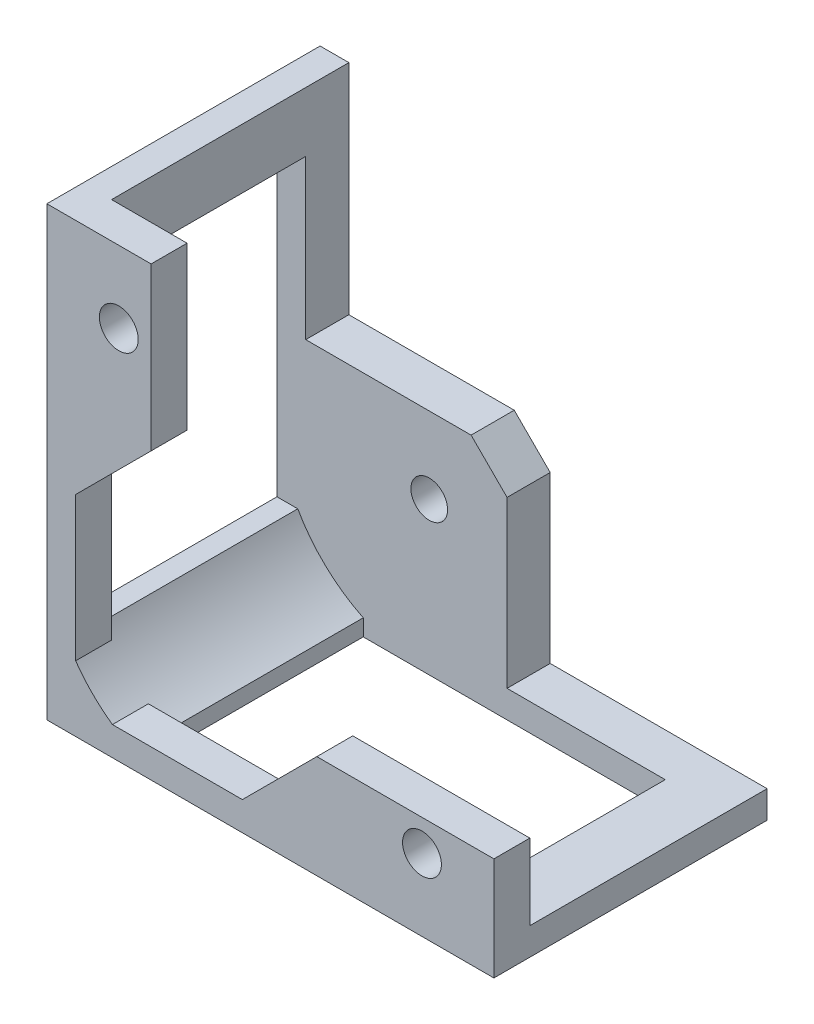
ISO-10303-21;
HEADER;
FILE_DESCRIPTION(('STEP AP214'),'2;1');
FILE_NAME('part.step','',(''),(''),'','','');
FILE_SCHEMA(('AUTOMOTIVE_DESIGN { 1 0 10303 214 1 1 1 1 }'));
ENDSEC;
DATA;
#1=APPLICATION_CONTEXT('core data for automotive mechanical design processes');
#2=APPLICATION_PROTOCOL_DEFINITION('international standard','automotive_design',2000,#1);
#3=PRODUCT_CONTEXT('',#1,'mechanical');
#4=PRODUCT('Part','Part','',(#3));
#5=PRODUCT_RELATED_PRODUCT_CATEGORY('part','',(#4));
#6=PRODUCT_DEFINITION_FORMATION('','',#4);
#7=PRODUCT_DEFINITION_CONTEXT('part definition',#1,'design');
#8=PRODUCT_DEFINITION('design','',#6,#7);
#9=PRODUCT_DEFINITION_SHAPE('','',#8);
#10=(LENGTH_UNIT() NAMED_UNIT(*) SI_UNIT(.MILLI.,.METRE.));
#11=(NAMED_UNIT(*) PLANE_ANGLE_UNIT() SI_UNIT($,.RADIAN.));
#12=(NAMED_UNIT(*) SI_UNIT($,.STERADIAN.) SOLID_ANGLE_UNIT());
#13=UNCERTAINTY_MEASURE_WITH_UNIT(LENGTH_MEASURE(1.E-05),#10,'distance_accuracy_value','');
#14=(GEOMETRIC_REPRESENTATION_CONTEXT(3) GLOBAL_UNCERTAINTY_ASSIGNED_CONTEXT((#13)) GLOBAL_UNIT_ASSIGNED_CONTEXT((#10,
#11,#12)) REPRESENTATION_CONTEXT('',''));
#15=CARTESIAN_POINT('',(0.,0.,0.));
#16=DIRECTION('',(0.,0.,1.));
#17=DIRECTION('',(1.,0.,0.));
#18=AXIS2_PLACEMENT_3D('',#15,#16,#17);
#19=CARTESIAN_POINT('',(-170.,-122.805556255077,-421.));
#20=DIRECTION('',(0.,0.,-1.));
#21=DIRECTION('',(1.,0.,0.));
#22=AXIS2_PLACEMENT_3D('',#19,#20,#21);
#23=CYLINDRICAL_SURFACE('',#22,2.7);
#24=CARTESIAN_POINT('',(-170.,-122.805556255077,-421.));
#25=DIRECTION('',(0.,0.,-1.));
#26=DIRECTION('',(1.,0.,0.));
#27=AXIS2_PLACEMENT_3D('',#24,#25,#26);
#28=CIRCLE('',#27,2.7);
#29=CARTESIAN_POINT('',(-172.7,-122.805556255077,-421.));
#30=VERTEX_POINT('',#29);
#31=EDGE_CURVE('E460',#30,#30,#28,.T.);
#32=ORIENTED_EDGE('',*,*,#31,.T.);
#33=DIRECTION('',(0.,0.,1.));
#34=VECTOR('',#33,1.);
#35=CARTESIAN_POINT('',(-172.7,-122.805556255077,-421.));
#36=LINE('',#35,#34);
#37=CARTESIAN_POINT('',(-172.7,-122.805556255077,-416.));
#38=VERTEX_POINT('',#37);
#39=EDGE_CURVE('E11',#30,#38,#36,.T.);
#40=ORIENTED_EDGE('',*,*,#39,.T.);
#41=CARTESIAN_POINT('',(-170.,-122.805556255077,-416.));
#42=DIRECTION('',(0.,0.,1.));
#43=DIRECTION('',(1.,0.,0.));
#44=AXIS2_PLACEMENT_3D('',#41,#42,#43);
#45=CIRCLE('',#44,2.7);
#46=EDGE_CURVE('E279',#38,#38,#45,.T.);
#47=ORIENTED_EDGE('',*,*,#46,.T.);
#48=ORIENTED_EDGE('',*,*,#39,.F.);
#49=EDGE_LOOP('',(#32,#40,#47,#48));
#50=FACE_BOUND('',#49,.T.);
#51=ADVANCED_FACE('F16',(#50),#23,.F.);
#52=CARTESIAN_POINT('',(-127.830959656274,-164.974596598802,-421.));
#53=DIRECTION('',(0.,0.,-1.));
#54=DIRECTION('',(1.,0.,0.));
#55=AXIS2_PLACEMENT_3D('',#52,#53,#54);
#56=CYLINDRICAL_SURFACE('',#55,2.7);
#57=CARTESIAN_POINT('',(-127.830959656274,-164.974596598802,-421.));
#58=DIRECTION('',(0.,0.,-1.));
#59=DIRECTION('',(1.,0.,0.));
#60=AXIS2_PLACEMENT_3D('',#57,#58,#59);
#61=CIRCLE('',#60,2.7);
#62=CARTESIAN_POINT('',(-130.530959656274,-164.974596598802,-421.));
#63=VERTEX_POINT('',#62);
#64=EDGE_CURVE('E339',#63,#63,#61,.T.);
#65=ORIENTED_EDGE('',*,*,#64,.T.);
#66=DIRECTION('',(0.,0.,1.));
#67=VECTOR('',#66,1.);
#68=CARTESIAN_POINT('',(-130.530959656274,-164.974596598802,-421.));
#69=LINE('',#68,#67);
#70=CARTESIAN_POINT('',(-130.530959656274,-164.974596598802,-416.));
#71=VERTEX_POINT('',#70);
#72=EDGE_CURVE('E27',#63,#71,#69,.T.);
#73=ORIENTED_EDGE('',*,*,#72,.T.);
#74=CARTESIAN_POINT('',(-127.830959656274,-164.974596598802,-416.));
#75=DIRECTION('',(0.,0.,1.));
#76=DIRECTION('',(1.,0.,0.));
#77=AXIS2_PLACEMENT_3D('',#74,#75,#76);
#78=CIRCLE('',#77,2.7);
#79=EDGE_CURVE('E331',#71,#71,#78,.T.);
#80=ORIENTED_EDGE('',*,*,#79,.T.);
#81=ORIENTED_EDGE('',*,*,#72,.F.);
#82=EDGE_LOOP('',(#65,#73,#80,#81));
#83=FACE_BOUND('',#82,.T.);
#84=ADVANCED_FACE('F932',(#83),#56,.F.);
#85=CARTESIAN_POINT('',(-144.000000730157,-148.037299163668,-421.));
#86=DIRECTION('',(0.,0.,1.));
#87=DIRECTION('',(1.,0.,0.));
#88=AXIS2_PLACEMENT_3D('',#85,#86,#87);
#89=PLANE('',#88);
#90=ORIENTED_EDGE('',*,*,#31,.F.);
#91=EDGE_LOOP('',(#90));
#92=FACE_BOUND('',#91,.T.);
#93=DIRECTION('',(0.,-1.,0.));
#94=VECTOR('',#93,1.);
#95=CARTESIAN_POINT('',(-165.504335240787,-140.685936356161,-421.));
#96=LINE('',#95,#94);
#97=CARTESIAN_POINT('',(-165.504335240787,-112.805556255077,-421.));
#98=VERTEX_POINT('',#97);
#99=CARTESIAN_POINT('',(-165.504335240787,-135.328908789441,-421.));
#100=VERTEX_POINT('',#99);
#101=EDGE_CURVE('E326',#98,#100,#96,.T.);
#102=ORIENTED_EDGE('',*,*,#101,.T.);
#103=DIRECTION('',(0.707106781186548,0.707106781186547,0.));
#104=VECTOR('',#103,1.);
#105=CARTESIAN_POINT('',(-165.430681586293,-135.255255134946,-421.));
#106=LINE('',#105,#104);
#107=CARTESIAN_POINT('',(-176.,-145.824573548653,-421.));
#108=VERTEX_POINT('',#107);
#109=EDGE_CURVE('E330',#108,#100,#106,.T.);
#110=ORIENTED_EDGE('',*,*,#109,.F.);
#111=DIRECTION('',(0.,-1.,0.));
#112=VECTOR('',#111,1.);
#113=CARTESIAN_POINT('',(-176.,-112.805556255077,-421.));
#114=LINE('',#113,#112);
#115=CARTESIAN_POINT('',(-176.,-165.858549293677,-421.));
#116=VERTEX_POINT('',#115);
#117=EDGE_CURVE('E449',#108,#116,#114,.T.);
#118=ORIENTED_EDGE('',*,*,#117,.T.);
#119=CARTESIAN_POINT('',(-158.82150839458,-153.796104993382,-421.));
#120=DIRECTION('',(0.,0.,1.));
#121=DIRECTION('',(1.,0.,0.));
#122=AXIS2_PLACEMENT_3D('',#119,#120,#121);
#123=CIRCLE('',#122,20.9905487383057);
#124=CARTESIAN_POINT('',(-177.109013287322,-164.100002369285,-421.000004917383));
#125=VERTEX_POINT('',#124);
#126=EDGE_CURVE('E425',#125,#116,#123,.T.);
#127=ORIENTED_EDGE('',*,*,#126,.F.);
#128=DIRECTION('',(1.,0.,0.));
#129=VECTOR('',#128,1.);
#130=CARTESIAN_POINT('',(-180.,-164.100002369285,-421.000004917383));
#131=LINE('',#130,#129);
#132=CARTESIAN_POINT('',(-180.,-164.100002369285,-421.000004917383));
#133=VERTEX_POINT('',#132);
#134=EDGE_CURVE('E439',#133,#125,#131,.T.);
#135=ORIENTED_EDGE('',*,*,#134,.F.);
#136=DIRECTION('',(0.,-1.,0.));
#137=VECTOR('',#136,1.);
#138=CARTESIAN_POINT('',(-180.,-121.100001728535,-421.000004917383));
#139=LINE('',#138,#137);
#140=CARTESIAN_POINT('',(-180.,-121.100001728535,-421.000004917383));
#141=VERTEX_POINT('',#140);
#142=EDGE_CURVE('E365',#141,#133,#139,.T.);
#143=ORIENTED_EDGE('',*,*,#142,.F.);
#144=DIRECTION('',(-1.,0.,0.));
#145=VECTOR('',#144,1.);
#146=CARTESIAN_POINT('',(-180.,-121.100001728535,-421.000004917383));
#147=LINE('',#146,#145);
#148=CARTESIAN_POINT('',(-176.,-121.100001728535,-421.000004917383));
#149=VERTEX_POINT('',#148);
#150=EDGE_CURVE('E445',#149,#141,#147,.T.);
#151=ORIENTED_EDGE('',*,*,#150,.F.);
#152=DIRECTION('',(0.,1.,0.));
#153=VECTOR('',#152,1.);
#154=CARTESIAN_POINT('',(-176.,-130.421427709373,-421.));
#155=LINE('',#154,#153);
#156=CARTESIAN_POINT('',(-176.,-112.805556255077,-421.));
#157=VERTEX_POINT('',#156);
#158=EDGE_CURVE('E377',#149,#157,#155,.T.);
#159=ORIENTED_EDGE('',*,*,#158,.T.);
#160=DIRECTION('',(-1.,0.,0.));
#161=VECTOR('',#160,1.);
#162=CARTESIAN_POINT('',(-160.,-112.805556255077,-421.));
#163=LINE('',#162,#161);
#164=EDGE_CURVE('E451',#98,#157,#163,.T.);
#165=ORIENTED_EDGE('',*,*,#164,.F.);
#166=EDGE_LOOP('',(#102,#110,#118,#127,#135,#143,#151,#159,#165));
#167=FACE_BOUND('',#166,.T.);
#168=ADVANCED_FACE('F639',(#92,#167),#89,.F.);
#169=CARTESIAN_POINT('',(-180.,-112.805556255077,-421.));
#170=DIRECTION('',(0.,-1.,0.));
#171=DIRECTION('',(0.,0.,-1.));
#172=AXIS2_PLACEMENT_3D('',#169,#170,#171);
#173=PLANE('',#172);
#174=ORIENTED_EDGE('',*,*,#164,.T.);
#175=DIRECTION('',(0.,0.,-1.));
#176=VECTOR('',#175,1.);
#177=CARTESIAN_POINT('',(-176.,-112.805556255077,-421.));
#178=LINE('',#177,#176);
#179=CARTESIAN_POINT('',(-176.,-112.805556255077,-454.));
#180=VERTEX_POINT('',#179);
#181=EDGE_CURVE('E382',#157,#180,#178,.T.);
#182=ORIENTED_EDGE('',*,*,#181,.T.);
#183=DIRECTION('',(1.,0.,0.));
#184=VECTOR('',#183,1.);
#185=CARTESIAN_POINT('',(-180.,-112.805556255077,-454.));
#186=LINE('',#185,#184);
#187=CARTESIAN_POINT('',(-180.,-112.805556255077,-454.));
#188=VERTEX_POINT('',#187);
#189=EDGE_CURVE('E413',#188,#180,#186,.T.);
#190=ORIENTED_EDGE('',*,*,#189,.F.);
#191=DIRECTION('',(0.,0.,1.));
#192=VECTOR('',#191,1.);
#193=CARTESIAN_POINT('',(-180.,-112.805556255077,-418.5));
#194=LINE('',#193,#192);
#195=CARTESIAN_POINT('',(-180.,-112.805556255077,-416.));
#196=VERTEX_POINT('',#195);
#197=EDGE_CURVE('E137',#188,#196,#194,.T.);
#198=ORIENTED_EDGE('',*,*,#197,.T.);
#199=DIRECTION('',(1.,0.,0.));
#200=VECTOR('',#199,1.);
#201=CARTESIAN_POINT('',(-166.004335240787,-112.805556255077,-416.));
#202=LINE('',#201,#200);
#203=CARTESIAN_POINT('',(-165.504335240787,-112.805556255077,-416.));
#204=VERTEX_POINT('',#203);
#205=EDGE_CURVE('E335',#196,#204,#202,.T.);
#206=ORIENTED_EDGE('',*,*,#205,.T.);
#207=DIRECTION('',(0.,0.,1.));
#208=VECTOR('',#207,1.);
#209=CARTESIAN_POINT('',(-165.504335240787,-112.805556255077,-418.5));
#210=LINE('',#209,#208);
#211=EDGE_CURVE('E329',#98,#204,#210,.T.);
#212=ORIENTED_EDGE('',*,*,#211,.F.);
#213=EDGE_LOOP('',(#174,#182,#190,#198,#206,#212));
#214=FACE_BOUND('',#213,.T.);
#215=ADVANCED_FACE('F644',(#214),#173,.F.);
#216=CARTESIAN_POINT('',(-137.960368081204,-170.974596598802,-416.));
#217=DIRECTION('',(0.,-1.,0.));
#218=DIRECTION('',(0.,0.,-1.));
#219=AXIS2_PLACEMENT_3D('',#216,#217,#218);
#220=PLANE('',#219);
#221=DIRECTION('',(0.,0.,1.));
#222=VECTOR('',#221,1.);
#223=CARTESIAN_POINT('',(-152.810368081204,-170.974596598802,-416.));
#224=LINE('',#223,#222);
#225=CARTESIAN_POINT('',(-152.810368081204,-170.974596598802,-421.));
#226=VERTEX_POINT('',#225);
#227=CARTESIAN_POINT('',(-152.810368081204,-170.974596598802,-416.));
#228=VERTEX_POINT('',#227);
#229=EDGE_CURVE('E444',#226,#228,#224,.T.);
#230=ORIENTED_EDGE('',*,*,#229,.F.);
#231=DIRECTION('',(1.,0.,0.));
#232=VECTOR('',#231,1.);
#233=CARTESIAN_POINT('',(-140.98018440568,-170.974596598802,-421.));
#234=LINE('',#233,#232);
#235=CARTESIAN_POINT('',(-170.883952694875,-170.974596598802,-421.));
#236=VERTEX_POINT('',#235);
#237=EDGE_CURVE('E285',#236,#226,#234,.T.);
#238=ORIENTED_EDGE('',*,*,#237,.F.);
#239=DIRECTION('',(0.,0.,-1.));
#240=VECTOR('',#239,1.);
#241=CARTESIAN_POINT('',(-170.883952694875,-170.974596598802,-454.));
#242=LINE('',#241,#240);
#243=CARTESIAN_POINT('',(-170.883952694875,-170.974596598802,-416.));
#244=VERTEX_POINT('',#243);
#245=EDGE_CURVE('E440',#244,#236,#242,.T.);
#246=ORIENTED_EDGE('',*,*,#245,.F.);
#247=DIRECTION('',(-1.,0.,0.));
#248=VECTOR('',#247,1.);
#249=CARTESIAN_POINT('',(-117.830959656274,-170.974596598802,-416.));
#250=LINE('',#249,#248);
#251=EDGE_CURVE('E376',#228,#244,#250,.T.);
#252=ORIENTED_EDGE('',*,*,#251,.F.);
#253=EDGE_LOOP('',(#230,#238,#246,#252));
#254=FACE_BOUND('',#253,.T.);
#255=ADVANCED_FACE('F612',(#254),#220,.F.);
#256=CARTESIAN_POINT('',(-126.000001728535,-174.974596598802,-425.000004902482));
#257=DIRECTION('',(1.,0.,0.));
#258=DIRECTION('',(0.,1.,0.));
#259=AXIS2_PLACEMENT_3D('',#256,#257,#258);
#260=PLANE('',#259);
#261=DIRECTION('',(0.,-1.,0.));
#262=VECTOR('',#261,1.);
#263=CARTESIAN_POINT('',(-126.000001728535,-164.385350796092,-448.));
#264=LINE('',#263,#262);
#265=CARTESIAN_POINT('',(-126.000001728535,-171.171527858595,-448.000005155802));
#266=VERTEX_POINT('',#265);
#267=CARTESIAN_POINT('',(-126.000001728535,-174.974596598802,-448.000005155802));
#268=VERTEX_POINT('',#267);
#269=EDGE_CURVE('E307',#266,#268,#264,.T.);
#270=ORIENTED_EDGE('',*,*,#269,.T.);
#271=DIRECTION('',(0.,0.,-1.));
#272=VECTOR('',#271,1.);
#273=CARTESIAN_POINT('',(-126.000001728535,-174.974596598802,-429.000002577901));
#274=LINE('',#273,#272);
#275=CARTESIAN_POINT('',(-126.000001728535,-174.974596598802,-421.000004902482));
#276=VERTEX_POINT('',#275);
#277=EDGE_CURVE('E441',#276,#268,#274,.T.);
#278=ORIENTED_EDGE('',*,*,#277,.F.);
#279=DIRECTION('',(0.,1.,0.));
#280=VECTOR('',#279,1.);
#281=CARTESIAN_POINT('',(-126.000001728535,-174.974596598802,-421.000004902482));
#282=LINE('',#281,#280);
#283=CARTESIAN_POINT('',(-126.000001728535,-171.171527858595,-421.000004902482));
#284=VERTEX_POINT('',#283);
#285=EDGE_CURVE('E474',#276,#284,#282,.T.);
#286=ORIENTED_EDGE('',*,*,#285,.T.);
#287=DIRECTION('',(0.,0.,1.));
#288=VECTOR('',#287,1.);
#289=CARTESIAN_POINT('',(-126.000001728535,-171.171527858595,-431.500002577901));
#290=LINE('',#289,#288);
#291=EDGE_CURVE('E269',#266,#284,#290,.T.);
#292=ORIENTED_EDGE('',*,*,#291,.F.);
#293=EDGE_LOOP('',(#270,#278,#286,#292));
#294=FACE_BOUND('',#293,.T.);
#295=ADVANCED_FACE('F597',(#294),#260,.F.);
#296=CARTESIAN_POINT('',(-176.,-112.805556255077,-421.));
#297=DIRECTION('',(1.,0.,0.));
#298=DIRECTION('',(0.,1.,0.));
#299=AXIS2_PLACEMENT_3D('',#296,#297,#298);
#300=PLANE('',#299);
#301=DIRECTION('',(0.,0.,-1.));
#302=VECTOR('',#301,1.);
#303=CARTESIAN_POINT('',(-176.,-145.824573548653,-418.5));
#304=LINE('',#303,#302);
#305=CARTESIAN_POINT('',(-176.,-145.824573548653,-416.));
#306=VERTEX_POINT('',#305);
#307=EDGE_CURVE('E398',#306,#108,#304,.T.);
#308=ORIENTED_EDGE('',*,*,#307,.F.);
#309=DIRECTION('',(0.,-1.,0.));
#310=VECTOR('',#309,1.);
#311=CARTESIAN_POINT('',(-176.,-112.805556255077,-416.));
#312=LINE('',#311,#310);
#313=CARTESIAN_POINT('',(-176.,-165.858549293677,-416.));
#314=VERTEX_POINT('',#313);
#315=EDGE_CURVE('E426',#306,#314,#312,.T.);
#316=ORIENTED_EDGE('',*,*,#315,.T.);
#317=DIRECTION('',(0.,0.,1.));
#318=VECTOR('',#317,1.);
#319=CARTESIAN_POINT('',(-176.,-165.858549293677,-454.));
#320=LINE('',#319,#318);
#321=EDGE_CURVE('E480',#116,#314,#320,.T.);
#322=ORIENTED_EDGE('',*,*,#321,.F.);
#323=ORIENTED_EDGE('',*,*,#117,.F.);
#324=EDGE_LOOP('',(#308,#316,#322,#323));
#325=FACE_BOUND('',#324,.T.);
#326=ADVANCED_FACE('F656',(#325),#300,.T.);
#327=CARTESIAN_POINT('',(-145.385368081204,-163.549596598802,-416.));
#328=DIRECTION('',(-0.707106781186548,0.707106781186548,0.));
#329=DIRECTION('',(0.,0.,1.));
#330=AXIS2_PLACEMENT_3D('',#327,#328,#329);
#331=PLANE('',#330);
#332=DIRECTION('',(0.,0.,-1.));
#333=VECTOR('',#332,1.);
#334=CARTESIAN_POINT('',(-142.459098244505,-160.623326762104,-418.5));
#335=LINE('',#334,#333);
#336=CARTESIAN_POINT('',(-142.459098244505,-160.623326762104,-416.));
#337=VERTEX_POINT('',#336);
#338=CARTESIAN_POINT('',(-142.459098244505,-160.623326762104,-421.));
#339=VERTEX_POINT('',#338);
#340=EDGE_CURVE('E343',#337,#339,#335,.T.);
#341=ORIENTED_EDGE('',*,*,#340,.T.);
#342=DIRECTION('',(-0.707106781186548,-0.707106781186548,0.));
#343=VECTOR('',#342,1.);
#344=CARTESIAN_POINT('',(-141.160951884659,-159.325180402257,-421.));
#345=LINE('',#344,#343);
#346=EDGE_CURVE('E289',#339,#226,#345,.T.);
#347=ORIENTED_EDGE('',*,*,#346,.T.);
#348=ORIENTED_EDGE('',*,*,#229,.T.);
#349=DIRECTION('',(0.707106781186548,0.707106781186548,0.));
#350=VECTOR('',#349,1.);
#351=CARTESIAN_POINT('',(-141.160951884659,-159.325180402257,-416.));
#352=LINE('',#351,#350);
#353=EDGE_CURVE('E324',#228,#337,#352,.T.);
#354=ORIENTED_EDGE('',*,*,#353,.T.);
#355=EDGE_LOOP('',(#341,#347,#348,#354));
#356=FACE_BOUND('',#355,.T.);
#357=ADVANCED_FACE('F615',(#356),#331,.T.);
#358=CARTESIAN_POINT('',(-180.,-174.974596598802,-416.));
#359=DIRECTION('',(0.,1.,0.));
#360=DIRECTION('',(1.,0.,0.));
#361=AXIS2_PLACEMENT_3D('',#358,#359,#360);
#362=PLANE('',#361);
#363=ORIENTED_EDGE('',*,*,#277,.T.);
#364=DIRECTION('',(1.,0.,0.));
#365=VECTOR('',#364,1.);
#366=CARTESIAN_POINT('',(-153.000000864267,-174.974596598802,-448.000005155802));
#367=LINE('',#366,#365);
#368=CARTESIAN_POINT('',(-168.000002354383,-174.974596598802,-448.000005155802));
#369=VERTEX_POINT('',#368);
#370=EDGE_CURVE('E387',#369,#268,#367,.T.);
#371=ORIENTED_EDGE('',*,*,#370,.F.);
#372=DIRECTION('',(0.,0.,1.));
#373=VECTOR('',#372,1.);
#374=CARTESIAN_POINT('',(-168.000002354383,-174.974596598802,-429.000002577901));
#375=LINE('',#374,#373);
#376=CARTESIAN_POINT('',(-168.000002354383,-174.974596598802,-421.000004902482));
#377=VERTEX_POINT('',#376);
#378=EDGE_CURVE('E436',#369,#377,#375,.T.);
#379=ORIENTED_EDGE('',*,*,#378,.T.);
#380=DIRECTION('',(1.,0.,0.));
#381=VECTOR('',#380,1.);
#382=CARTESIAN_POINT('',(-174.000001177192,-174.974596598802,-421.000004902482));
#383=LINE('',#382,#381);
#384=EDGE_CURVE('E409',#377,#276,#383,.T.);
#385=ORIENTED_EDGE('',*,*,#384,.T.);
#386=EDGE_LOOP('',(#363,#371,#379,#385));
#387=FACE_BOUND('',#386,.T.);
#388=DIRECTION('',(-1.,0.,0.));
#389=VECTOR('',#388,1.);
#390=CARTESIAN_POINT('',(-117.830959656274,-174.974596598802,-454.));
#391=LINE('',#390,#389);
#392=CARTESIAN_POINT('',(-117.830959656274,-174.974596598802,-454.));
#393=VERTEX_POINT('',#392);
#394=CARTESIAN_POINT('',(-180.,-174.974596598802,-454.));
#395=VERTEX_POINT('',#394);
#396=EDGE_CURVE('E301',#393,#395,#391,.T.);
#397=ORIENTED_EDGE('',*,*,#396,.F.);
#398=DIRECTION('',(0.,0.,-1.));
#399=VECTOR('',#398,1.);
#400=CARTESIAN_POINT('',(-117.830959656274,-174.974596598802,-418.5));
#401=LINE('',#400,#399);
#402=CARTESIAN_POINT('',(-117.830959656274,-174.974596598802,-416.));
#403=VERTEX_POINT('',#402);
#404=EDGE_CURVE('E348',#403,#393,#401,.T.);
#405=ORIENTED_EDGE('',*,*,#404,.F.);
#406=DIRECTION('',(1.,0.,0.));
#407=VECTOR('',#406,1.);
#408=CARTESIAN_POINT('',(-180.,-174.974596598802,-416.));
#409=LINE('',#408,#407);
#410=CARTESIAN_POINT('',(-180.,-174.974596598802,-416.));
#411=VERTEX_POINT('',#410);
#412=EDGE_CURVE('E372',#411,#403,#409,.T.);
#413=ORIENTED_EDGE('',*,*,#412,.F.);
#414=DIRECTION('',(0.,0.,-1.));
#415=VECTOR('',#414,1.);
#416=CARTESIAN_POINT('',(-180.,-174.974596598802,-416.));
#417=LINE('',#416,#415);
#418=EDGE_CURVE('E381',#411,#395,#417,.T.);
#419=ORIENTED_EDGE('',*,*,#418,.T.);
#420=EDGE_LOOP('',(#397,#405,#413,#419));
#421=FACE_BOUND('',#420,.T.);
#422=ADVANCED_FACE('F600',(#387,#421),#362,.F.);
#423=CARTESIAN_POINT('',(-180.,-121.100001728535,-443.000005170703));
#424=DIRECTION('',(0.,1.,0.));
#425=DIRECTION('',(1.,0.,0.));
#426=AXIS2_PLACEMENT_3D('',#423,#424,#425);
#427=PLANE('',#426);
#428=DIRECTION('',(1.,0.,0.));
#429=VECTOR('',#428,1.);
#430=CARTESIAN_POINT('',(-169.41075419729,-121.100001728535,-448.));
#431=LINE('',#430,#429);
#432=CARTESIAN_POINT('',(-180.,-121.100001728535,-448.000005170703));
#433=VERTEX_POINT('',#432);
#434=CARTESIAN_POINT('',(-176.,-121.100001728535,-448.000005170703));
#435=VERTEX_POINT('',#434);
#436=EDGE_CURVE('E351',#433,#435,#431,.T.);
#437=ORIENTED_EDGE('',*,*,#436,.T.);
#438=DIRECTION('',(0.,0.,-1.));
#439=VECTOR('',#438,1.);
#440=CARTESIAN_POINT('',(-176.,-121.100001728535,-423.500002458692));
#441=LINE('',#440,#439);
#442=EDGE_CURVE('E312',#149,#435,#441,.T.);
#443=ORIENTED_EDGE('',*,*,#442,.F.);
#444=ORIENTED_EDGE('',*,*,#150,.T.);
#445=DIRECTION('',(0.,0.,1.));
#446=VECTOR('',#445,1.);
#447=CARTESIAN_POINT('',(-180.,-121.100001728535,-421.000002458692));
#448=LINE('',#447,#446);
#449=EDGE_CURVE('E361',#433,#141,#448,.T.);
#450=ORIENTED_EDGE('',*,*,#449,.F.);
#451=EDGE_LOOP('',(#437,#443,#444,#450));
#452=FACE_BOUND('',#451,.T.);
#453=ADVANCED_FACE('F675',(#452),#427,.F.);
#454=CARTESIAN_POINT('',(-180.,-164.100002369285,-426.000004917383));
#455=DIRECTION('',(0.,-1.,0.));
#456=DIRECTION('',(0.,0.,-1.));
#457=AXIS2_PLACEMENT_3D('',#454,#455,#456);
#458=PLANE('',#457);
#459=DIRECTION('',(-1.,0.,0.));
#460=VECTOR('',#459,1.);
#461=CARTESIAN_POINT('',(-169.41075419729,-164.100002369285,-448.));
#462=LINE('',#461,#460);
#463=CARTESIAN_POINT('',(-177.109013287322,-164.100002369285,-448.000005170703));
#464=VERTEX_POINT('',#463);
#465=CARTESIAN_POINT('',(-180.,-164.100002369285,-448.000005170703));
#466=VERTEX_POINT('',#465);
#467=EDGE_CURVE('E366',#464,#466,#462,.T.);
#468=ORIENTED_EDGE('',*,*,#467,.T.);
#469=DIRECTION('',(0.,0.,-1.));
#470=VECTOR('',#469,1.);
#471=CARTESIAN_POINT('',(-180.,-164.100002369285,-421.000002458692));
#472=LINE('',#471,#470);
#473=EDGE_CURVE('E466',#133,#466,#472,.T.);
#474=ORIENTED_EDGE('',*,*,#473,.F.);
#475=ORIENTED_EDGE('',*,*,#134,.T.);
#476=DIRECTION('',(0.,0.,1.));
#477=VECTOR('',#476,1.);
#478=CARTESIAN_POINT('',(-177.109013287322,-164.100002369285,-454.));
#479=LINE('',#478,#477);
#480=EDGE_CURVE('E421',#464,#125,#479,.T.);
#481=ORIENTED_EDGE('',*,*,#480,.F.);
#482=EDGE_LOOP('',(#468,#474,#475,#481));
#483=FACE_BOUND('',#482,.T.);
#484=ADVANCED_FACE('F661',(#483),#458,.F.);
#485=CARTESIAN_POINT('',(-168.000002354383,-174.974596598802,-442.000005155802));
#486=DIRECTION('',(-1.,0.,0.));
#487=DIRECTION('',(0.,0.,1.));
#488=AXIS2_PLACEMENT_3D('',#485,#486,#487);
#489=PLANE('',#488);
#490=DIRECTION('',(0.,1.,0.));
#491=VECTOR('',#490,1.);
#492=CARTESIAN_POINT('',(-168.000002354383,-164.385350796092,-448.));
#493=LINE('',#492,#491);
#494=CARTESIAN_POINT('',(-168.000002354383,-172.673562051075,-448.000005155802));
#495=VERTEX_POINT('',#494);
#496=EDGE_CURVE('E383',#369,#495,#493,.T.);
#497=ORIENTED_EDGE('',*,*,#496,.T.);
#498=DIRECTION('',(0.,0.,-1.));
#499=VECTOR('',#498,1.);
#500=CARTESIAN_POINT('',(-168.000002354383,-172.673562051075,-454.));
#501=LINE('',#500,#499);
#502=CARTESIAN_POINT('',(-168.000002354383,-172.673562051075,-421.000004902482));
#503=VERTEX_POINT('',#502);
#504=EDGE_CURVE('E306',#503,#495,#501,.T.);
#505=ORIENTED_EDGE('',*,*,#504,.F.);
#506=DIRECTION('',(0.,-1.,0.));
#507=VECTOR('',#506,1.);
#508=CARTESIAN_POINT('',(-168.000002354383,-174.974596598802,-421.000004902482));
#509=LINE('',#508,#507);
#510=EDGE_CURVE('E405',#503,#377,#509,.T.);
#511=ORIENTED_EDGE('',*,*,#510,.T.);
#512=ORIENTED_EDGE('',*,*,#378,.F.);
#513=EDGE_LOOP('',(#497,#505,#511,#512));
#514=FACE_BOUND('',#513,.T.);
#515=ADVANCED_FACE('F18',(#514),#489,.F.);
#516=CARTESIAN_POINT('',(-158.82150839458,-153.796104993382,-454.));
#517=DIRECTION('',(0.,0.,1.));
#518=DIRECTION('',(1.,0.,0.));
#519=AXIS2_PLACEMENT_3D('',#516,#517,#518);
#520=CYLINDRICAL_SURFACE('',#519,20.9905487383057);
#521=ORIENTED_EDGE('',*,*,#504,.T.);
#522=CARTESIAN_POINT('',(-158.82150839458,-153.796104993382,-448.));
#523=DIRECTION('',(0.,0.,-1.));
#524=DIRECTION('',(1.,0.,0.));
#525=AXIS2_PLACEMENT_3D('',#522,#523,#524);
#526=CIRCLE('',#525,20.9905487383057);
#527=EDGE_CURVE('E20',#495,#464,#526,.T.);
#528=ORIENTED_EDGE('',*,*,#527,.T.);
#529=ORIENTED_EDGE('',*,*,#480,.T.);
#530=ORIENTED_EDGE('',*,*,#126,.T.);
#531=ORIENTED_EDGE('',*,*,#321,.T.);
#532=CARTESIAN_POINT('',(-158.82150839458,-153.796104993382,-416.));
#533=DIRECTION('',(0.,0.,-1.));
#534=DIRECTION('',(1.,0.,0.));
#535=AXIS2_PLACEMENT_3D('',#532,#533,#534);
#536=CIRCLE('',#535,20.9905487383057);
#537=EDGE_CURVE('E430',#244,#314,#536,.T.);
#538=ORIENTED_EDGE('',*,*,#537,.F.);
#539=ORIENTED_EDGE('',*,*,#245,.T.);
#540=CARTESIAN_POINT('',(-158.82150839458,-153.796104993382,-421.));
#541=DIRECTION('',(0.,0.,1.));
#542=DIRECTION('',(1.,0.,0.));
#543=AXIS2_PLACEMENT_3D('',#540,#541,#542);
#544=CIRCLE('',#543,20.9905487383057);
#545=EDGE_CURVE('E290',#236,#503,#544,.T.);
#546=ORIENTED_EDGE('',*,*,#545,.T.);
#547=EDGE_LOOP('',(#521,#528,#529,#530,#531,#538,#539,#546));
#548=FACE_BOUND('',#547,.T.);
#549=ADVANCED_FACE('F607',(#548),#520,.F.);
#550=CARTESIAN_POINT('',(-147.999504675882,-141.733660693088,-454.));
#551=DIRECTION('',(-1.,0.,0.));
#552=DIRECTION('',(0.,0.,1.));
#553=AXIS2_PLACEMENT_3D('',#550,#551,#552);
#554=PLANE('',#553);
#555=DIRECTION('',(0.,0.,-1.));
#556=VECTOR('',#555,1.);
#557=CARTESIAN_POINT('',(-147.999504675882,-148.171660693088,-454.));
#558=LINE('',#557,#556);
#559=CARTESIAN_POINT('',(-147.999504675882,-148.171660693088,-448.));
#560=VERTEX_POINT('',#559);
#561=CARTESIAN_POINT('',(-147.999504675882,-148.171660693088,-454.));
#562=VERTEX_POINT('',#561);
#563=EDGE_CURVE('E296',#560,#562,#558,.T.);
#564=ORIENTED_EDGE('',*,*,#563,.F.);
#565=DIRECTION('',(0.,1.,0.));
#566=VECTOR('',#565,1.);
#567=CARTESIAN_POINT('',(-147.999504675882,-147.764882843235,-448.));
#568=LINE('',#567,#566);
#569=CARTESIAN_POINT('',(-147.999504675882,-171.171527858595,-448.));
#570=VERTEX_POINT('',#569);
#571=EDGE_CURVE('E303',#570,#560,#568,.T.);
#572=ORIENTED_EDGE('',*,*,#571,.F.);
#573=DIRECTION('',(0.,0.,1.));
#574=VECTOR('',#573,1.);
#575=CARTESIAN_POINT('',(-147.999504675882,-171.171527858595,-421.));
#576=LINE('',#575,#574);
#577=CARTESIAN_POINT('',(-147.999504675882,-171.171527858595,-454.));
#578=VERTEX_POINT('',#577);
#579=EDGE_CURVE('E355',#578,#570,#576,.T.);
#580=ORIENTED_EDGE('',*,*,#579,.F.);
#581=DIRECTION('',(0.,-1.,0.));
#582=VECTOR('',#581,1.);
#583=CARTESIAN_POINT('',(-147.999504675882,-147.764882843235,-454.));
#584=LINE('',#583,#582);
#585=EDGE_CURVE('E500',#562,#578,#584,.T.);
#586=ORIENTED_EDGE('',*,*,#585,.F.);
#587=EDGE_LOOP('',(#564,#572,#580,#586));
#588=FACE_BOUND('',#587,.T.);
#589=ADVANCED_FACE('F628',(#588),#554,.F.);
#590=CARTESIAN_POINT('',(-176.,-143.171660693088,-454.));
#591=DIRECTION('',(0.,-1.,0.));
#592=DIRECTION('',(0.,0.,-1.));
#593=AXIS2_PLACEMENT_3D('',#590,#591,#592);
#594=PLANE('',#593);
#595=DIRECTION('',(0.,0.,1.));
#596=VECTOR('',#595,1.);
#597=CARTESIAN_POINT('',(-152.999504675882,-143.171660693088,-454.));
#598=LINE('',#597,#596);
#599=CARTESIAN_POINT('',(-152.999504675882,-143.171660693088,-454.));
#600=VERTEX_POINT('',#599);
#601=CARTESIAN_POINT('',(-152.999504675882,-143.171660693088,-448.));
#602=VERTEX_POINT('',#601);
#603=EDGE_CURVE('E291',#600,#602,#598,.T.);
#604=ORIENTED_EDGE('',*,*,#603,.F.);
#605=DIRECTION('',(1.,0.,0.));
#606=VECTOR('',#605,1.);
#607=CARTESIAN_POINT('',(-167.41075419729,-143.171660693088,-454.));
#608=LINE('',#607,#606);
#609=CARTESIAN_POINT('',(-176.,-143.171660693088,-454.));
#610=VERTEX_POINT('',#609);
#611=EDGE_CURVE('E314',#610,#600,#608,.T.);
#612=ORIENTED_EDGE('',*,*,#611,.F.);
#613=DIRECTION('',(0.,0.,-1.));
#614=VECTOR('',#613,1.);
#615=CARTESIAN_POINT('',(-176.,-143.171660693088,-449.));
#616=LINE('',#615,#614);
#617=CARTESIAN_POINT('',(-176.,-143.171660693088,-448.));
#618=VERTEX_POINT('',#617);
#619=EDGE_CURVE('E520',#618,#610,#616,.T.);
#620=ORIENTED_EDGE('',*,*,#619,.F.);
#621=DIRECTION('',(-1.,0.,0.));
#622=VECTOR('',#621,1.);
#623=CARTESIAN_POINT('',(-167.41075419729,-143.171660693088,-448.));
#624=LINE('',#623,#622);
#625=EDGE_CURVE('E295',#602,#618,#624,.T.);
#626=ORIENTED_EDGE('',*,*,#625,.F.);
#627=EDGE_LOOP('',(#604,#612,#620,#626));
#628=FACE_BOUND('',#627,.T.);
#629=ADVANCED_FACE('F985',(#628),#594,.F.);
#630=CARTESIAN_POINT('',(-158.82150839458,-153.796104993382,-448.));
#631=DIRECTION('',(0.,0.,-1.));
#632=DIRECTION('',(0.,-1.,0.));
#633=AXIS2_PLACEMENT_3D('',#630,#631,#632);
#634=PLANE('',#633);
#635=CARTESIAN_POINT('',(-158.82150839458,-153.796104993382,-448.));
#636=DIRECTION('',(0.,0.,-1.));
#637=DIRECTION('',(-1.,0.,0.));
#638=AXIS2_PLACEMENT_3D('',#635,#636,#637);
#639=CIRCLE('',#638,2.55);
#640=CARTESIAN_POINT('',(-156.27150839458,-153.796104993382,-448.));
#641=VERTEX_POINT('',#640);
#642=EDGE_CURVE('E265',#641,#641,#639,.T.);
#643=ORIENTED_EDGE('',*,*,#642,.T.);
#644=EDGE_LOOP('',(#643));
#645=FACE_BOUND('',#644,.T.);
#646=DIRECTION('',(0.707106781186548,-0.707106781186548,0.));
#647=VECTOR('',#646,1.);
#648=CARTESIAN_POINT('',(-150.548894530483,-145.622270838487,-448.));
#649=LINE('',#648,#647);
#650=EDGE_CURVE('E344',#602,#560,#649,.T.);
#651=ORIENTED_EDGE('',*,*,#650,.F.);
#652=ORIENTED_EDGE('',*,*,#625,.T.);
#653=DIRECTION('',(0.,1.,0.));
#654=VECTOR('',#653,1.);
#655=CARTESIAN_POINT('',(-176.,-147.764882843235,-448.));
#656=LINE('',#655,#654);
#657=CARTESIAN_POINT('',(-176.,-141.733660693088,-448.));
#658=VERTEX_POINT('',#657);
#659=EDGE_CURVE('E518',#618,#658,#656,.T.);
#660=ORIENTED_EDGE('',*,*,#659,.T.);
#661=DIRECTION('',(0.,1.,0.));
#662=VECTOR('',#661,1.);
#663=CARTESIAN_POINT('',(-176.,-138.452779312181,-448.000005170703));
#664=LINE('',#663,#662);
#665=EDGE_CURVE('E496',#658,#435,#664,.T.);
#666=ORIENTED_EDGE('',*,*,#665,.T.);
#667=ORIENTED_EDGE('',*,*,#436,.F.);
#668=DIRECTION('',(0.,-1.,0.));
#669=VECTOR('',#668,1.);
#670=CARTESIAN_POINT('',(-180.,-142.60000204891,-448.000005170703));
#671=LINE('',#670,#669);
#672=EDGE_CURVE('E399',#433,#466,#671,.T.);
#673=ORIENTED_EDGE('',*,*,#672,.T.);
#674=ORIENTED_EDGE('',*,*,#467,.F.);
#675=ORIENTED_EDGE('',*,*,#527,.F.);
#676=ORIENTED_EDGE('',*,*,#496,.F.);
#677=ORIENTED_EDGE('',*,*,#370,.T.);
#678=ORIENTED_EDGE('',*,*,#269,.F.);
#679=DIRECTION('',(-1.,0.,0.));
#680=VECTOR('',#679,1.);
#681=CARTESIAN_POINT('',(-136.522253202208,-171.171527858595,-448.000005155802));
#682=LINE('',#681,#680);
#683=CARTESIAN_POINT('',(-147.044504675882,-171.171527858595,-448.));
#684=VERTEX_POINT('',#683);
#685=EDGE_CURVE('E308',#266,#684,#682,.T.);
#686=ORIENTED_EDGE('',*,*,#685,.T.);
#687=DIRECTION('',(-1.,0.,0.));
#688=VECTOR('',#687,1.);
#689=CARTESIAN_POINT('',(-152.933006535231,-171.171527858595,-448.));
#690=LINE('',#689,#688);
#691=EDGE_CURVE('E313',#684,#570,#690,.T.);
#692=ORIENTED_EDGE('',*,*,#691,.T.);
#693=ORIENTED_EDGE('',*,*,#571,.T.);
#694=EDGE_LOOP('',(#651,#652,#660,#666,#667,#673,#674,#675,#676,#677,#678,#686,#692,#693));
#695=FACE_BOUND('',#694,.T.);
#696=ADVANCED_FACE('F266',(#645,#695),#634,.F.);
#697=CARTESIAN_POINT('',(-150.499504675882,-145.671660693088,-454.));
#698=DIRECTION('',(0.707106781186548,0.707106781186548,0.));
#699=DIRECTION('',(0.,0.,-1.));
#700=AXIS2_PLACEMENT_3D('',#697,#698,#699);
#701=PLANE('',#700);
#702=ORIENTED_EDGE('',*,*,#650,.T.);
#703=ORIENTED_EDGE('',*,*,#563,.T.);
#704=DIRECTION('',(-0.707106781186548,0.707106781186548,0.));
#705=VECTOR('',#704,1.);
#706=CARTESIAN_POINT('',(-150.548894530483,-145.622270838487,-454.));
#707=LINE('',#706,#705);
#708=EDGE_CURVE('E318',#562,#600,#707,.T.);
#709=ORIENTED_EDGE('',*,*,#708,.T.);
#710=ORIENTED_EDGE('',*,*,#603,.T.);
#711=EDGE_LOOP('',(#702,#703,#709,#710));
#712=FACE_BOUND('',#711,.T.);
#713=ADVANCED_FACE('F855',(#712),#701,.T.);
#714=CARTESIAN_POINT('',(-117.830959656274,-174.974596598802,-421.));
#715=DIRECTION('',(1.,0.,0.));
#716=DIRECTION('',(0.,1.,0.));
#717=AXIS2_PLACEMENT_3D('',#714,#715,#716);
#718=PLANE('',#717);
#719=DIRECTION('',(0.,0.,1.));
#720=VECTOR('',#719,1.);
#721=CARTESIAN_POINT('',(-117.830959656274,-160.623326762104,-418.5));
#722=LINE('',#721,#720);
#723=CARTESIAN_POINT('',(-117.830959656274,-160.623326762104,-421.));
#724=VERTEX_POINT('',#723);
#725=CARTESIAN_POINT('',(-117.830959656274,-160.623326762104,-416.));
#726=VERTEX_POINT('',#725);
#727=EDGE_CURVE('E516',#724,#726,#722,.T.);
#728=ORIENTED_EDGE('',*,*,#727,.T.);
#729=DIRECTION('',(0.,-1.,0.));
#730=VECTOR('',#729,1.);
#731=CARTESIAN_POINT('',(-117.830959656274,-161.505947881235,-416.));
#732=LINE('',#731,#730);
#733=EDGE_CURVE('E325',#726,#403,#732,.T.);
#734=ORIENTED_EDGE('',*,*,#733,.T.);
#735=ORIENTED_EDGE('',*,*,#404,.T.);
#736=DIRECTION('',(0.,-1.,0.));
#737=VECTOR('',#736,1.);
#738=CARTESIAN_POINT('',(-117.830959656274,-171.171527858595,-454.));
#739=LINE('',#738,#737);
#740=CARTESIAN_POINT('',(-117.830959656274,-171.171527858595,-454.));
#741=VERTEX_POINT('',#740);
#742=EDGE_CURVE('E297',#741,#393,#739,.T.);
#743=ORIENTED_EDGE('',*,*,#742,.F.);
#744=DIRECTION('',(0.,0.,-1.));
#745=VECTOR('',#744,1.);
#746=CARTESIAN_POINT('',(-117.830959656274,-171.171527858595,-421.));
#747=LINE('',#746,#745);
#748=CARTESIAN_POINT('',(-117.830959656274,-171.171527858595,-421.));
#749=VERTEX_POINT('',#748);
#750=EDGE_CURVE('E394',#749,#741,#747,.T.);
#751=ORIENTED_EDGE('',*,*,#750,.F.);
#752=DIRECTION('',(0.,1.,0.));
#753=VECTOR('',#752,1.);
#754=CARTESIAN_POINT('',(-117.830959656274,-161.505947881235,-421.));
#755=LINE('',#754,#753);
#756=EDGE_CURVE('E470',#749,#724,#755,.T.);
#757=ORIENTED_EDGE('',*,*,#756,.T.);
#758=EDGE_LOOP('',(#728,#734,#735,#743,#751,#757));
#759=FACE_BOUND('',#758,.T.);
#760=ADVANCED_FACE('F585',(#759),#718,.T.);
#761=CARTESIAN_POINT('',(-117.830959656274,-160.623326762104,-416.));
#762=DIRECTION('',(0.,-1.,0.));
#763=DIRECTION('',(0.,0.,-1.));
#764=AXIS2_PLACEMENT_3D('',#761,#762,#763);
#765=PLANE('',#764);
#766=DIRECTION('',(1.,0.,0.));
#767=VECTOR('',#766,1.);
#768=CARTESIAN_POINT('',(-140.98018440568,-160.623326762104,-421.));
#769=LINE('',#768,#767);
#770=EDGE_CURVE('E338',#339,#724,#769,.T.);
#771=ORIENTED_EDGE('',*,*,#770,.F.);
#772=ORIENTED_EDGE('',*,*,#340,.F.);
#773=DIRECTION('',(-1.,0.,0.));
#774=VECTOR('',#773,1.);
#775=CARTESIAN_POINT('',(-140.98018440568,-160.623326762104,-416.));
#776=LINE('',#775,#774);
#777=EDGE_CURVE('E320',#726,#337,#776,.T.);
#778=ORIENTED_EDGE('',*,*,#777,.F.);
#779=ORIENTED_EDGE('',*,*,#727,.F.);
#780=EDGE_LOOP('',(#771,#772,#778,#779));
#781=FACE_BOUND('',#780,.T.);
#782=ADVANCED_FACE('F581',(#781),#765,.F.);
#783=CARTESIAN_POINT('',(-144.000000730157,-148.037299163668,-421.));
#784=DIRECTION('',(0.,0.,1.));
#785=DIRECTION('',(1.,0.,0.));
#786=AXIS2_PLACEMENT_3D('',#783,#784,#785);
#787=PLANE('',#786);
#788=ORIENTED_EDGE('',*,*,#64,.F.);
#789=EDGE_LOOP('',(#788));
#790=FACE_BOUND('',#789,.T.);
#791=ORIENTED_EDGE('',*,*,#770,.T.);
#792=ORIENTED_EDGE('',*,*,#756,.F.);
#793=DIRECTION('',(-1.,0.,0.));
#794=VECTOR('',#793,1.);
#795=CARTESIAN_POINT('',(-145.52225270302,-171.171527858595,-421.));
#796=LINE('',#795,#794);
#797=EDGE_CURVE('E277',#749,#284,#796,.T.);
#798=ORIENTED_EDGE('',*,*,#797,.T.);
#799=ORIENTED_EDGE('',*,*,#285,.F.);
#800=ORIENTED_EDGE('',*,*,#384,.F.);
#801=ORIENTED_EDGE('',*,*,#510,.F.);
#802=ORIENTED_EDGE('',*,*,#545,.F.);
#803=ORIENTED_EDGE('',*,*,#237,.T.);
#804=ORIENTED_EDGE('',*,*,#346,.F.);
#805=EDGE_LOOP('',(#791,#792,#798,#799,#800,#801,#802,#803,#804));
#806=FACE_BOUND('',#805,.T.);
#807=ADVANCED_FACE('F575',(#790,#806),#787,.F.);
#808=CARTESIAN_POINT('',(-165.504335240787,-133.334573548653,-416.));
#809=DIRECTION('',(1.,0.,0.));
#810=DIRECTION('',(0.,1.,0.));
#811=AXIS2_PLACEMENT_3D('',#808,#809,#810);
#812=PLANE('',#811);
#813=ORIENTED_EDGE('',*,*,#101,.F.);
#814=ORIENTED_EDGE('',*,*,#211,.T.);
#815=DIRECTION('',(0.,-1.,0.));
#816=VECTOR('',#815,1.);
#817=CARTESIAN_POINT('',(-165.504335240787,-140.685936356161,-416.));
#818=LINE('',#817,#816);
#819=CARTESIAN_POINT('',(-165.504335240787,-135.328908789441,-416.));
#820=VERTEX_POINT('',#819);
#821=EDGE_CURVE('E356',#204,#820,#818,.T.);
#822=ORIENTED_EDGE('',*,*,#821,.T.);
#823=DIRECTION('',(0.,0.,1.));
#824=VECTOR('',#823,1.);
#825=CARTESIAN_POINT('',(-165.504335240787,-135.328908789441,-417.25));
#826=LINE('',#825,#824);
#827=EDGE_CURVE('E395',#100,#820,#826,.T.);
#828=ORIENTED_EDGE('',*,*,#827,.F.);
#829=EDGE_LOOP('',(#813,#814,#822,#828));
#830=FACE_BOUND('',#829,.T.);
#831=ADVANCED_FACE('F648',(#830),#812,.T.);
#832=CARTESIAN_POINT('',(-169.755,-139.579573548653,-418.5));
#833=DIRECTION('',(0.707106781186547,-0.707106781186548,0.));
#834=DIRECTION('',(0.,0.,-1.));
#835=AXIS2_PLACEMENT_3D('',#832,#833,#834);
#836=PLANE('',#835);
#837=ORIENTED_EDGE('',*,*,#827,.T.);
#838=DIRECTION('',(-0.707106781186548,-0.707106781186547,0.));
#839=VECTOR('',#838,1.);
#840=CARTESIAN_POINT('',(-165.430681586293,-135.255255134946,-416.));
#841=LINE('',#840,#839);
#842=EDGE_CURVE('E360',#820,#306,#841,.T.);
#843=ORIENTED_EDGE('',*,*,#842,.T.);
#844=ORIENTED_EDGE('',*,*,#307,.T.);
#845=ORIENTED_EDGE('',*,*,#109,.T.);
#846=EDGE_LOOP('',(#837,#843,#844,#845));
#847=FACE_BOUND('',#846,.T.);
#848=ADVANCED_FACE('F651',(#847),#836,.T.);
#849=CARTESIAN_POINT('',(-180.,-121.100001728535,-416.));
#850=DIRECTION('',(1.,0.,0.));
#851=DIRECTION('',(0.,1.,0.));
#852=AXIS2_PLACEMENT_3D('',#849,#850,#851);
#853=PLANE('',#852);
#854=ORIENTED_EDGE('',*,*,#449,.T.);
#855=ORIENTED_EDGE('',*,*,#142,.T.);
#856=ORIENTED_EDGE('',*,*,#473,.T.);
#857=ORIENTED_EDGE('',*,*,#672,.F.);
#858=EDGE_LOOP('',(#854,#855,#856,#857));
#859=FACE_BOUND('',#858,.T.);
#860=DIRECTION('',(0.,1.,0.));
#861=VECTOR('',#860,1.);
#862=CARTESIAN_POINT('',(-180.,-171.171527858595,-454.));
#863=LINE('',#862,#861);
#864=EDGE_CURVE('E417',#395,#188,#863,.T.);
#865=ORIENTED_EDGE('',*,*,#864,.F.);
#866=ORIENTED_EDGE('',*,*,#418,.F.);
#867=DIRECTION('',(0.,-1.,0.));
#868=VECTOR('',#867,1.);
#869=CARTESIAN_POINT('',(-180.,-121.100001728535,-416.));
#870=LINE('',#869,#868);
#871=EDGE_CURVE('E484',#196,#411,#870,.T.);
#872=ORIENTED_EDGE('',*,*,#871,.F.);
#873=ORIENTED_EDGE('',*,*,#197,.F.);
#874=EDGE_LOOP('',(#865,#866,#872,#873));
#875=FACE_BOUND('',#874,.T.);
#876=ADVANCED_FACE('F672',(#859,#875),#853,.F.);
#877=CARTESIAN_POINT('',(-176.,-112.805556255077,-421.));
#878=DIRECTION('',(1.,0.,0.));
#879=DIRECTION('',(0.,1.,0.));
#880=AXIS2_PLACEMENT_3D('',#877,#878,#879);
#881=PLANE('',#880);
#882=ORIENTED_EDGE('',*,*,#442,.T.);
#883=ORIENTED_EDGE('',*,*,#665,.F.);
#884=ORIENTED_EDGE('',*,*,#659,.F.);
#885=ORIENTED_EDGE('',*,*,#619,.T.);
#886=DIRECTION('',(0.,-1.,0.));
#887=VECTOR('',#886,1.);
#888=CARTESIAN_POINT('',(-176.,-147.764882843235,-454.));
#889=LINE('',#888,#887);
#890=EDGE_CURVE('E319',#180,#610,#889,.T.);
#891=ORIENTED_EDGE('',*,*,#890,.F.);
#892=ORIENTED_EDGE('',*,*,#181,.F.);
#893=ORIENTED_EDGE('',*,*,#158,.F.);
#894=EDGE_LOOP('',(#882,#883,#884,#885,#891,#892,#893));
#895=FACE_BOUND('',#894,.T.);
#896=ADVANCED_FACE('F868',(#895),#881,.T.);
#897=CARTESIAN_POINT('',(-147.044504675882,-171.171527858595,-421.));
#898=DIRECTION('',(0.,1.,0.));
#899=DIRECTION('',(1.,0.,0.));
#900=AXIS2_PLACEMENT_3D('',#897,#898,#899);
#901=PLANE('',#900);
#902=ORIENTED_EDGE('',*,*,#291,.T.);
#903=ORIENTED_EDGE('',*,*,#797,.F.);
#904=ORIENTED_EDGE('',*,*,#750,.T.);
#905=DIRECTION('',(1.,0.,0.));
#906=VECTOR('',#905,1.);
#907=CARTESIAN_POINT('',(-176.,-171.171527858595,-454.));
#908=LINE('',#907,#906);
#909=EDGE_CURVE('E302',#578,#741,#908,.T.);
#910=ORIENTED_EDGE('',*,*,#909,.F.);
#911=ORIENTED_EDGE('',*,*,#579,.T.);
#912=ORIENTED_EDGE('',*,*,#691,.F.);
#913=ORIENTED_EDGE('',*,*,#685,.F.);
#914=EDGE_LOOP('',(#902,#903,#904,#910,#911,#912,#913));
#915=FACE_BOUND('',#914,.T.);
#916=ADVANCED_FACE('F590',(#915),#901,.T.);
#917=CARTESIAN_POINT('',(-158.82150839458,-153.796104993382,-448.));
#918=DIRECTION('',(0.,0.,-1.));
#919=DIRECTION('',(-1.,0.,0.));
#920=AXIS2_PLACEMENT_3D('',#917,#918,#919);
#921=CYLINDRICAL_SURFACE('',#920,2.55);
#922=CARTESIAN_POINT('',(-158.82150839458,-153.796104993382,-454.));
#923=DIRECTION('',(0.,0.,1.));
#924=DIRECTION('',(-1.,0.,0.));
#925=AXIS2_PLACEMENT_3D('',#922,#923,#924);
#926=CIRCLE('',#925,2.55);
#927=CARTESIAN_POINT('',(-156.27150839458,-153.796104993382,-454.));
#928=VERTEX_POINT('',#927);
#929=EDGE_CURVE('E283',#928,#928,#926,.T.);
#930=ORIENTED_EDGE('',*,*,#929,.F.);
#931=DIRECTION('',(0.,0.,1.));
#932=VECTOR('',#931,1.);
#933=CARTESIAN_POINT('',(-156.27150839458,-153.796104993382,-448.));
#934=LINE('',#933,#932);
#935=EDGE_CURVE('E125',#928,#641,#934,.T.);
#936=ORIENTED_EDGE('',*,*,#935,.T.);
#937=ORIENTED_EDGE('',*,*,#642,.F.);
#938=ORIENTED_EDGE('',*,*,#935,.F.);
#939=EDGE_LOOP('',(#930,#936,#937,#938));
#940=FACE_BOUND('',#939,.T.);
#941=ADVANCED_FACE('F867',(#940),#921,.F.);
#942=CARTESIAN_POINT('',(-144.000000730157,-148.037299163668,-416.));
#943=DIRECTION('',(0.,0.,1.));
#944=DIRECTION('',(1.,0.,0.));
#945=AXIS2_PLACEMENT_3D('',#942,#943,#944);
#946=PLANE('',#945);
#947=ORIENTED_EDGE('',*,*,#46,.F.);
#948=EDGE_LOOP('',(#947));
#949=FACE_BOUND('',#948,.T.);
#950=ORIENTED_EDGE('',*,*,#79,.F.);
#951=EDGE_LOOP('',(#950));
#952=FACE_BOUND('',#951,.T.);
#953=ORIENTED_EDGE('',*,*,#871,.T.);
#954=ORIENTED_EDGE('',*,*,#412,.T.);
#955=ORIENTED_EDGE('',*,*,#733,.F.);
#956=ORIENTED_EDGE('',*,*,#777,.T.);
#957=ORIENTED_EDGE('',*,*,#353,.F.);
#958=ORIENTED_EDGE('',*,*,#251,.T.);
#959=ORIENTED_EDGE('',*,*,#537,.T.);
#960=ORIENTED_EDGE('',*,*,#315,.F.);
#961=ORIENTED_EDGE('',*,*,#842,.F.);
#962=ORIENTED_EDGE('',*,*,#821,.F.);
#963=ORIENTED_EDGE('',*,*,#205,.F.);
#964=EDGE_LOOP('',(#953,#954,#955,#956,#957,#958,#959,#960,#961,#962,#963));
#965=FACE_BOUND('',#964,.T.);
#966=ADVANCED_FACE('F617',(#949,#952,#965),#946,.T.);
#967=CARTESIAN_POINT('',(-158.82150839458,-153.796104993382,-454.));
#968=DIRECTION('',(0.,0.,1.));
#969=DIRECTION('',(1.,0.,0.));
#970=AXIS2_PLACEMENT_3D('',#967,#968,#969);
#971=PLANE('',#970);
#972=ORIENTED_EDGE('',*,*,#929,.T.);
#973=EDGE_LOOP('',(#972));
#974=FACE_BOUND('',#973,.T.);
#975=ORIENTED_EDGE('',*,*,#864,.T.);
#976=ORIENTED_EDGE('',*,*,#189,.T.);
#977=ORIENTED_EDGE('',*,*,#890,.T.);
#978=ORIENTED_EDGE('',*,*,#611,.T.);
#979=ORIENTED_EDGE('',*,*,#708,.F.);
#980=ORIENTED_EDGE('',*,*,#585,.T.);
#981=ORIENTED_EDGE('',*,*,#909,.T.);
#982=ORIENTED_EDGE('',*,*,#742,.T.);
#983=ORIENTED_EDGE('',*,*,#396,.T.);
#984=EDGE_LOOP('',(#975,#976,#977,#978,#979,#980,#981,#982,#983));
#985=FACE_BOUND('',#984,.T.);
#986=ADVANCED_FACE('F622',(#974,#985),#971,.F.);
#987=CLOSED_SHELL('',(#51,#84,#168,#215,#255,#295,#326,#357,#422,#453,#484,#515,#549,#589,#629,
#696,#713,#760,#782,#807,#831,#848,#876,#896,#916,#941,#966,#986));
#988=MANIFOLD_SOLID_BREP('B1',#987);
#989=ADVANCED_BREP_SHAPE_REPRESENTATION('',(#18,#988),#14);
#990=SHAPE_DEFINITION_REPRESENTATION(#9,#989);
ENDSEC;
END-ISO-10303-21;
